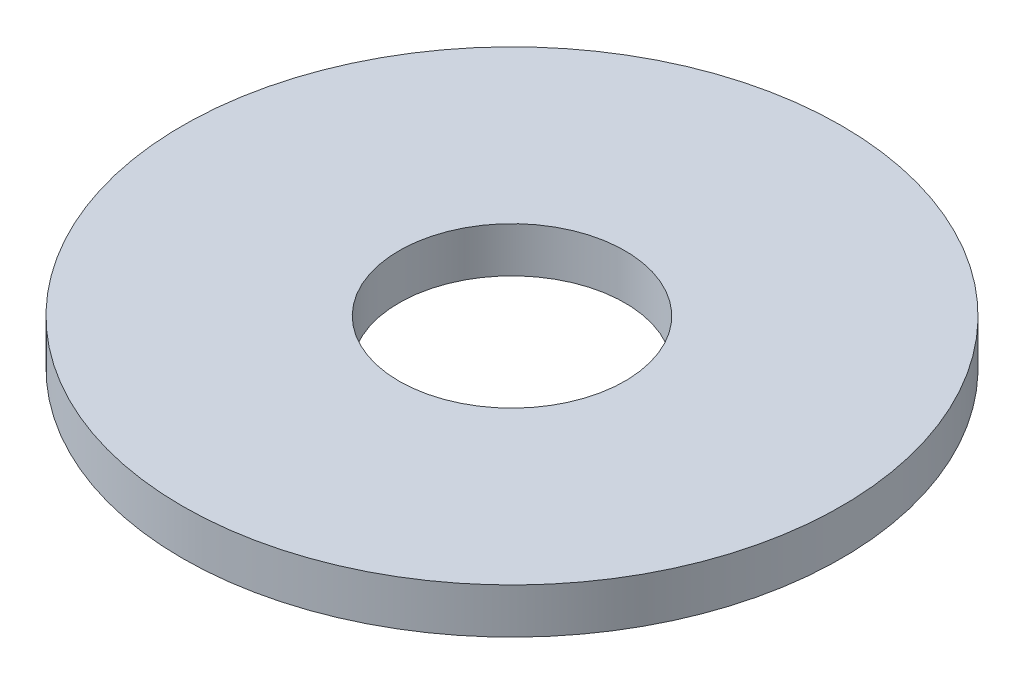
ISO-10303-21;
HEADER;
FILE_DESCRIPTION(('STEP AP214'),'2;1');
FILE_NAME('part.step','',(''),(''),'','','');
FILE_SCHEMA(('AUTOMOTIVE_DESIGN { 1 0 10303 214 1 1 1 1 }'));
ENDSEC;
DATA;
#1=APPLICATION_CONTEXT('core data for automotive mechanical design processes');
#2=APPLICATION_PROTOCOL_DEFINITION('international standard','automotive_design',2000,#1);
#3=PRODUCT_CONTEXT('',#1,'mechanical');
#4=PRODUCT('Part','Part','',(#3));
#5=PRODUCT_RELATED_PRODUCT_CATEGORY('part','',(#4));
#6=PRODUCT_DEFINITION_FORMATION('','',#4);
#7=PRODUCT_DEFINITION_CONTEXT('part definition',#1,'design');
#8=PRODUCT_DEFINITION('design','',#6,#7);
#9=PRODUCT_DEFINITION_SHAPE('','',#8);
#10=(LENGTH_UNIT() NAMED_UNIT(*) SI_UNIT(.MILLI.,.METRE.));
#11=(NAMED_UNIT(*) PLANE_ANGLE_UNIT() SI_UNIT($,.RADIAN.));
#12=(NAMED_UNIT(*) SI_UNIT($,.STERADIAN.) SOLID_ANGLE_UNIT());
#13=UNCERTAINTY_MEASURE_WITH_UNIT(LENGTH_MEASURE(1.E-05),#10,'distance_accuracy_value','');
#14=(GEOMETRIC_REPRESENTATION_CONTEXT(3) GLOBAL_UNCERTAINTY_ASSIGNED_CONTEXT((#13)) GLOBAL_UNIT_ASSIGNED_CONTEXT((#10,
#11,#12)) REPRESENTATION_CONTEXT('',''));
#15=CARTESIAN_POINT('',(0.,0.,0.));
#16=DIRECTION('',(0.,0.,1.));
#17=DIRECTION('',(1.,0.,0.));
#18=AXIS2_PLACEMENT_3D('',#15,#16,#17);
#19=CARTESIAN_POINT('',(0.,12.,0.));
#20=DIRECTION('',(0.,-1.,0.));
#21=DIRECTION('',(0.,0.,-1.));
#22=AXIS2_PLACEMENT_3D('',#19,#20,#21);
#23=CYLINDRICAL_SURFACE('',#22,87.5);
#24=CARTESIAN_POINT('',(0.,12.,0.));
#25=DIRECTION('',(0.,1.,0.));
#26=DIRECTION('',(0.,0.,1.));
#27=AXIS2_PLACEMENT_3D('',#24,#25,#26);
#28=CIRCLE('',#27,87.5);
#29=CARTESIAN_POINT('',(0.,12.,87.5));
#30=VERTEX_POINT('',#29);
#31=EDGE_CURVE('E10',#30,#30,#28,.T.);
#32=ORIENTED_EDGE('',*,*,#31,.F.);
#33=EDGE_LOOP('',(#32));
#34=FACE_BOUND('',#33,.T.);
#35=CARTESIAN_POINT('',(0.,0.,0.));
#36=DIRECTION('',(0.,1.,0.));
#37=DIRECTION('',(0.,0.,1.));
#38=AXIS2_PLACEMENT_3D('',#35,#36,#37);
#39=CIRCLE('',#38,87.5);
#40=CARTESIAN_POINT('',(0.,0.,87.5));
#41=VERTEX_POINT('',#40);
#42=EDGE_CURVE('E37',#41,#41,#39,.T.);
#43=ORIENTED_EDGE('',*,*,#42,.T.);
#44=EDGE_LOOP('',(#43));
#45=FACE_BOUND('',#44,.T.);
#46=ADVANCED_FACE('F40',(#34,#45),#23,.T.);
#47=CARTESIAN_POINT('',(0.,12.,0.));
#48=DIRECTION('',(0.,1.,0.));
#49=DIRECTION('',(0.,0.,1.));
#50=AXIS2_PLACEMENT_3D('',#47,#48,#49);
#51=PLANE('',#50);
#52=CARTESIAN_POINT('',(0.,12.,0.));
#53=DIRECTION('',(0.,1.,0.));
#54=DIRECTION('',(0.,0.,1.));
#55=AXIS2_PLACEMENT_3D('',#52,#53,#54);
#56=CIRCLE('',#55,30.);
#57=CARTESIAN_POINT('',(0.,12.,30.));
#58=VERTEX_POINT('',#57);
#59=EDGE_CURVE('E50',#58,#58,#56,.T.);
#60=ORIENTED_EDGE('',*,*,#59,.F.);
#61=EDGE_LOOP('',(#60));
#62=FACE_BOUND('',#61,.T.);
#63=ORIENTED_EDGE('',*,*,#31,.T.);
#64=EDGE_LOOP('',(#63));
#65=FACE_BOUND('',#64,.T.);
#66=ADVANCED_FACE('F59',(#62,#65),#51,.T.);
#67=CARTESIAN_POINT('',(0.,0.,0.));
#68=DIRECTION('',(0.,1.,0.));
#69=DIRECTION('',(0.,0.,1.));
#70=AXIS2_PLACEMENT_3D('',#67,#68,#69);
#71=PLANE('',#70);
#72=CARTESIAN_POINT('',(0.,0.,0.));
#73=DIRECTION('',(0.,1.,0.));
#74=DIRECTION('',(0.,0.,1.));
#75=AXIS2_PLACEMENT_3D('',#72,#73,#74);
#76=CIRCLE('',#75,30.);
#77=CARTESIAN_POINT('',(0.,0.,30.));
#78=VERTEX_POINT('',#77);
#79=EDGE_CURVE('E47',#78,#78,#76,.T.);
#80=ORIENTED_EDGE('',*,*,#79,.T.);
#81=EDGE_LOOP('',(#80));
#82=FACE_BOUND('',#81,.T.);
#83=ORIENTED_EDGE('',*,*,#42,.F.);
#84=EDGE_LOOP('',(#83));
#85=FACE_BOUND('',#84,.T.);
#86=ADVANCED_FACE('F58',(#82,#85),#71,.F.);
#87=CARTESIAN_POINT('',(0.,12.,0.));
#88=DIRECTION('',(0.,-1.,0.));
#89=DIRECTION('',(0.,0.,-1.));
#90=AXIS2_PLACEMENT_3D('',#87,#88,#89);
#91=CYLINDRICAL_SURFACE('',#90,30.);
#92=ORIENTED_EDGE('',*,*,#59,.T.);
#93=EDGE_LOOP('',(#92));
#94=FACE_BOUND('',#93,.T.);
#95=ORIENTED_EDGE('',*,*,#79,.F.);
#96=EDGE_LOOP('',(#95));
#97=FACE_BOUND('',#96,.T.);
#98=ADVANCED_FACE('F54',(#94,#97),#91,.F.);
#99=CLOSED_SHELL('',(#46,#66,#86,#98));
#100=MANIFOLD_SOLID_BREP('B2',#99);
#101=ADVANCED_BREP_SHAPE_REPRESENTATION('',(#18,#100),#14);
#102=SHAPE_DEFINITION_REPRESENTATION(#9,#101);
ENDSEC;
END-ISO-10303-21;
